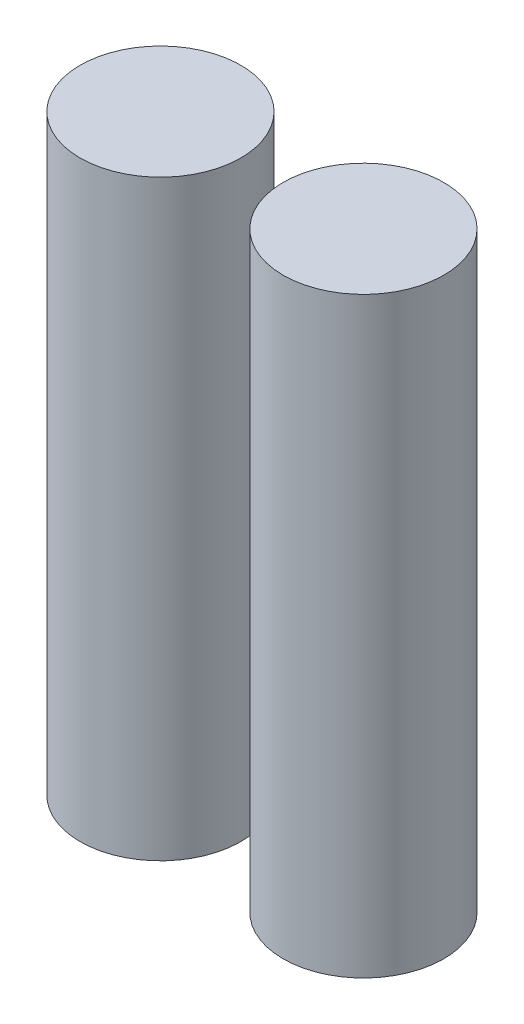
ISO-10303-21;
HEADER;
FILE_DESCRIPTION(('STEP AP214'),'2;1');
FILE_NAME('part.step','',(''),(''),'','','');
FILE_SCHEMA(('AUTOMOTIVE_DESIGN { 1 0 10303 214 1 1 1 1 }'));
ENDSEC;
DATA;
#1=APPLICATION_CONTEXT('core data for automotive mechanical design processes');
#2=APPLICATION_PROTOCOL_DEFINITION('international standard','automotive_design',2000,#1);
#3=PRODUCT_CONTEXT('',#1,'mechanical');
#4=PRODUCT('Part','Part','',(#3));
#5=PRODUCT_RELATED_PRODUCT_CATEGORY('part','',(#4));
#6=PRODUCT_DEFINITION_FORMATION('','',#4);
#7=PRODUCT_DEFINITION_CONTEXT('part definition',#1,'design');
#8=PRODUCT_DEFINITION('design','',#6,#7);
#9=PRODUCT_DEFINITION_SHAPE('','',#8);
#10=(LENGTH_UNIT() NAMED_UNIT(*) SI_UNIT(.MILLI.,.METRE.));
#11=(NAMED_UNIT(*) PLANE_ANGLE_UNIT() SI_UNIT($,.RADIAN.));
#12=(NAMED_UNIT(*) SI_UNIT($,.STERADIAN.) SOLID_ANGLE_UNIT());
#13=UNCERTAINTY_MEASURE_WITH_UNIT(LENGTH_MEASURE(1.E-05),#10,'distance_accuracy_value','');
#14=(GEOMETRIC_REPRESENTATION_CONTEXT(3) GLOBAL_UNCERTAINTY_ASSIGNED_CONTEXT((#13)) GLOBAL_UNIT_ASSIGNED_CONTEXT((#10,
#11,#12)) REPRESENTATION_CONTEXT('',''));
#15=CARTESIAN_POINT('',(0.,0.,0.));
#16=DIRECTION('',(0.,0.,1.));
#17=DIRECTION('',(1.,0.,0.));
#18=AXIS2_PLACEMENT_3D('',#15,#16,#17);
#19=CARTESIAN_POINT('',(-12.,70.,0.));
#20=DIRECTION('',(0.,-1.,0.));
#21=DIRECTION('',(0.,0.,-1.));
#22=AXIS2_PLACEMENT_3D('',#19,#20,#21);
#23=CYLINDRICAL_SURFACE('',#22,9.5);
#24=CARTESIAN_POINT('',(-12.,70.,0.));
#25=DIRECTION('',(0.,1.,0.));
#26=DIRECTION('',(0.,0.,1.));
#27=AXIS2_PLACEMENT_3D('',#24,#25,#26);
#28=CIRCLE('',#27,9.5);
#29=CARTESIAN_POINT('',(-12.,70.,9.5));
#30=VERTEX_POINT('',#29);
#31=EDGE_CURVE('E43',#30,#30,#28,.T.);
#32=ORIENTED_EDGE('',*,*,#31,.F.);
#33=EDGE_LOOP('',(#32));
#34=FACE_BOUND('',#33,.T.);
#35=CARTESIAN_POINT('',(-12.,0.,0.));
#36=DIRECTION('',(0.,1.,0.));
#37=DIRECTION('',(0.,0.,1.));
#38=AXIS2_PLACEMENT_3D('',#35,#36,#37);
#39=CIRCLE('',#38,9.5);
#40=CARTESIAN_POINT('',(-12.,0.,9.5));
#41=VERTEX_POINT('',#40);
#42=EDGE_CURVE('E11',#41,#41,#39,.T.);
#43=ORIENTED_EDGE('',*,*,#42,.T.);
#44=EDGE_LOOP('',(#43));
#45=FACE_BOUND('',#44,.T.);
#46=ADVANCED_FACE('F39',(#34,#45),#23,.T.);
#47=CARTESIAN_POINT('',(-12.,70.,0.));
#48=DIRECTION('',(0.,1.,0.));
#49=DIRECTION('',(0.,0.,1.));
#50=AXIS2_PLACEMENT_3D('',#47,#48,#49);
#51=PLANE('',#50);
#52=ORIENTED_EDGE('',*,*,#31,.T.);
#53=EDGE_LOOP('',(#52));
#54=FACE_BOUND('',#53,.T.);
#55=ADVANCED_FACE('F41',(#54),#51,.T.);
#56=CARTESIAN_POINT('',(-12.,0.,0.));
#57=DIRECTION('',(0.,1.,0.));
#58=DIRECTION('',(0.,0.,1.));
#59=AXIS2_PLACEMENT_3D('',#56,#57,#58);
#60=PLANE('',#59);
#61=ORIENTED_EDGE('',*,*,#42,.F.);
#62=EDGE_LOOP('',(#61));
#63=FACE_BOUND('',#62,.T.);
#64=ADVANCED_FACE('F58',(#63),#60,.F.);
#65=CLOSED_SHELL('',(#46,#55,#64));
#66=MANIFOLD_SOLID_BREP('B2',#65);
#67=CARTESIAN_POINT('',(12.,70.,0.));
#68=DIRECTION('',(0.,-1.,0.));
#69=DIRECTION('',(0.,0.,-1.));
#70=AXIS2_PLACEMENT_3D('',#67,#68,#69);
#71=CYLINDRICAL_SURFACE('',#70,9.5);
#72=CARTESIAN_POINT('',(12.,70.,0.));
#73=DIRECTION('',(0.,1.,0.));
#74=DIRECTION('',(0.,0.,1.));
#75=AXIS2_PLACEMENT_3D('',#72,#73,#74);
#76=CIRCLE('',#75,9.5);
#77=CARTESIAN_POINT('',(12.,70.,9.5));
#78=VERTEX_POINT('',#77);
#79=EDGE_CURVE('E38',#78,#78,#76,.T.);
#80=ORIENTED_EDGE('',*,*,#79,.F.);
#81=EDGE_LOOP('',(#80));
#82=FACE_BOUND('',#81,.T.);
#83=CARTESIAN_POINT('',(12.,0.,0.));
#84=DIRECTION('',(0.,1.,0.));
#85=DIRECTION('',(0.,0.,1.));
#86=AXIS2_PLACEMENT_3D('',#83,#84,#85);
#87=CIRCLE('',#86,9.5);
#88=CARTESIAN_POINT('',(12.,0.,9.5));
#89=VERTEX_POINT('',#88);
#90=EDGE_CURVE('E83',#89,#89,#87,.T.);
#91=ORIENTED_EDGE('',*,*,#90,.T.);
#92=EDGE_LOOP('',(#91));
#93=FACE_BOUND('',#92,.T.);
#94=ADVANCED_FACE('F80',(#82,#93),#71,.T.);
#95=CARTESIAN_POINT('',(12.,70.,0.));
#96=DIRECTION('',(0.,1.,0.));
#97=DIRECTION('',(0.,0.,1.));
#98=AXIS2_PLACEMENT_3D('',#95,#96,#97);
#99=PLANE('',#98);
#100=ORIENTED_EDGE('',*,*,#79,.T.);
#101=EDGE_LOOP('',(#100));
#102=FACE_BOUND('',#101,.T.);
#103=ADVANCED_FACE('F95',(#102),#99,.T.);
#104=CARTESIAN_POINT('',(12.,0.,0.));
#105=DIRECTION('',(0.,1.,0.));
#106=DIRECTION('',(0.,0.,1.));
#107=AXIS2_PLACEMENT_3D('',#104,#105,#106);
#108=PLANE('',#107);
#109=ORIENTED_EDGE('',*,*,#90,.F.);
#110=EDGE_LOOP('',(#109));
#111=FACE_BOUND('',#110,.T.);
#112=ADVANCED_FACE('F93',(#111),#108,.F.);
#113=CLOSED_SHELL('',(#94,#103,#112));
#114=MANIFOLD_SOLID_BREP('B6',#113);
#115=ADVANCED_BREP_SHAPE_REPRESENTATION('',(#18,#66,#114),#14);
#116=SHAPE_DEFINITION_REPRESENTATION(#9,#115);
ENDSEC;
END-ISO-10303-21;
